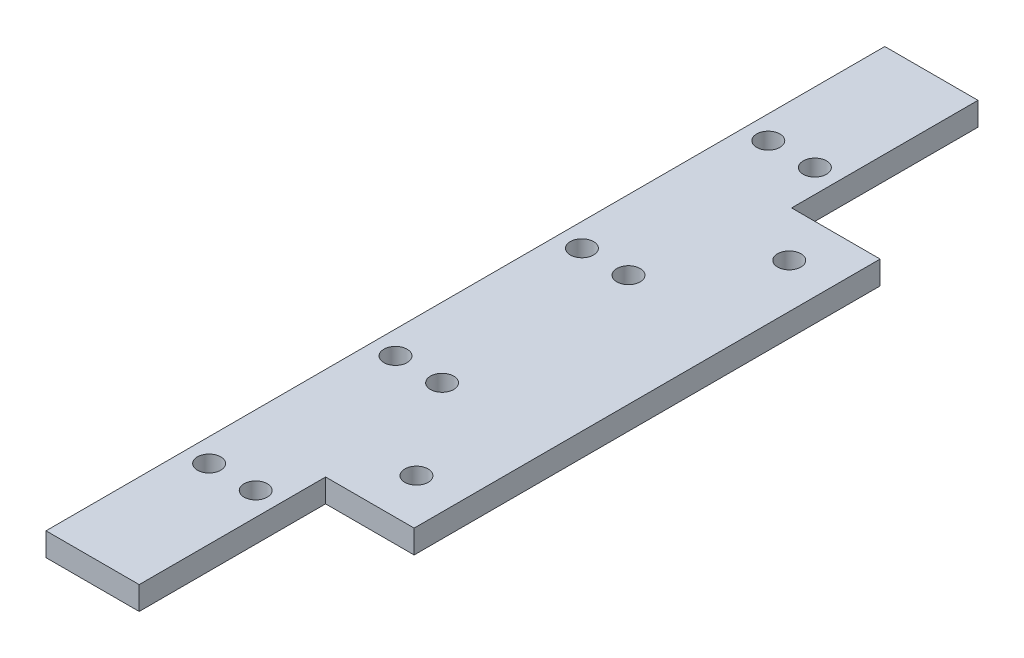
ISO-10303-21;
HEADER;
FILE_DESCRIPTION(('STEP AP214'),'2;1');
FILE_NAME('part.step','',(''),(''),'','','');
FILE_SCHEMA(('AUTOMOTIVE_DESIGN { 1 0 10303 214 1 1 1 1 }'));
ENDSEC;
DATA;
#1=APPLICATION_CONTEXT('core data for automotive mechanical design processes');
#2=APPLICATION_PROTOCOL_DEFINITION('international standard','automotive_design',2000,#1);
#3=PRODUCT_CONTEXT('',#1,'mechanical');
#4=PRODUCT('Part','Part','',(#3));
#5=PRODUCT_RELATED_PRODUCT_CATEGORY('part','',(#4));
#6=PRODUCT_DEFINITION_FORMATION('','',#4);
#7=PRODUCT_DEFINITION_CONTEXT('part definition',#1,'design');
#8=PRODUCT_DEFINITION('design','',#6,#7);
#9=PRODUCT_DEFINITION_SHAPE('','',#8);
#10=(LENGTH_UNIT() NAMED_UNIT(*) SI_UNIT(.MILLI.,.METRE.));
#11=(NAMED_UNIT(*) PLANE_ANGLE_UNIT() SI_UNIT($,.RADIAN.));
#12=(NAMED_UNIT(*) SI_UNIT($,.STERADIAN.) SOLID_ANGLE_UNIT());
#13=UNCERTAINTY_MEASURE_WITH_UNIT(LENGTH_MEASURE(1.E-05),#10,'distance_accuracy_value','');
#14=(GEOMETRIC_REPRESENTATION_CONTEXT(3) GLOBAL_UNCERTAINTY_ASSIGNED_CONTEXT((#13)) GLOBAL_UNIT_ASSIGNED_CONTEXT((#10,
#11,#12)) REPRESENTATION_CONTEXT('',''));
#15=CARTESIAN_POINT('',(0.,0.,0.));
#16=DIRECTION('',(0.,0.,1.));
#17=DIRECTION('',(1.,0.,0.));
#18=AXIS2_PLACEMENT_3D('',#15,#16,#17);
#19=CARTESIAN_POINT('',(0.,6.35,-127.));
#20=DIRECTION('',(0.,0.,1.));
#21=DIRECTION('',(1.,0.,0.));
#22=AXIS2_PLACEMENT_3D('',#19,#20,#21);
#23=PLANE('',#22);
#24=DIRECTION('',(0.,-1.,0.));
#25=VECTOR('',#24,1.);
#26=CARTESIAN_POINT('',(0.,6.35,-127.));
#27=LINE('',#26,#25);
#28=CARTESIAN_POINT('',(0.,6.35,-127.));
#29=VERTEX_POINT('',#28);
#30=CARTESIAN_POINT('',(0.,0.,-127.));
#31=VERTEX_POINT('',#30);
#32=EDGE_CURVE('E48',#29,#31,#27,.T.);
#33=ORIENTED_EDGE('',*,*,#32,.F.);
#34=DIRECTION('',(-1.,0.,0.));
#35=VECTOR('',#34,1.);
#36=CARTESIAN_POINT('',(0.,6.35,-127.));
#37=LINE('',#36,#35);
#38=CARTESIAN_POINT('',(24.13,6.35,-127.));
#39=VERTEX_POINT('',#38);
#40=EDGE_CURVE('E170',#39,#29,#37,.T.);
#41=ORIENTED_EDGE('',*,*,#40,.F.);
#42=DIRECTION('',(0.,-1.,0.));
#43=VECTOR('',#42,1.);
#44=CARTESIAN_POINT('',(24.13,6.35,-127.));
#45=LINE('',#44,#43);
#46=CARTESIAN_POINT('',(24.13,0.,-127.));
#47=VERTEX_POINT('',#46);
#48=EDGE_CURVE('E41',#39,#47,#45,.T.);
#49=ORIENTED_EDGE('',*,*,#48,.T.);
#50=DIRECTION('',(-1.,0.,0.));
#51=VECTOR('',#50,1.);
#52=CARTESIAN_POINT('',(0.,0.,-127.));
#53=LINE('',#52,#51);
#54=EDGE_CURVE('E168',#47,#31,#53,.T.);
#55=ORIENTED_EDGE('',*,*,#54,.T.);
#56=EDGE_LOOP('',(#33,#41,#49,#55));
#57=FACE_BOUND('',#56,.T.);
#58=ADVANCED_FACE('F33',(#57),#23,.F.);
#59=CARTESIAN_POINT('',(0.,6.35,0.));
#60=DIRECTION('',(0.,0.,-1.));
#61=DIRECTION('',(-1.,0.,0.));
#62=AXIS2_PLACEMENT_3D('',#59,#60,#61);
#63=PLANE('',#62);
#64=DIRECTION('',(0.,1.,0.));
#65=VECTOR('',#64,1.);
#66=CARTESIAN_POINT('',(0.,6.35,0.));
#67=LINE('',#66,#65);
#68=CARTESIAN_POINT('',(0.,0.,0.));
#69=VERTEX_POINT('',#68);
#70=CARTESIAN_POINT('',(0.,6.35,0.));
#71=VERTEX_POINT('',#70);
#72=EDGE_CURVE('E56',#69,#71,#67,.T.);
#73=ORIENTED_EDGE('',*,*,#72,.F.);
#74=DIRECTION('',(1.,0.,0.));
#75=VECTOR('',#74,1.);
#76=CARTESIAN_POINT('',(0.,0.,0.));
#77=LINE('',#76,#75);
#78=CARTESIAN_POINT('',(24.13,0.,0.));
#79=VERTEX_POINT('',#78);
#80=EDGE_CURVE('E156',#69,#79,#77,.T.);
#81=ORIENTED_EDGE('',*,*,#80,.T.);
#82=DIRECTION('',(0.,-1.,0.));
#83=VECTOR('',#82,1.);
#84=CARTESIAN_POINT('',(24.13,6.35,0.));
#85=LINE('',#84,#83);
#86=CARTESIAN_POINT('',(24.13,6.35,0.));
#87=VERTEX_POINT('',#86);
#88=EDGE_CURVE('E11',#87,#79,#85,.T.);
#89=ORIENTED_EDGE('',*,*,#88,.F.);
#90=DIRECTION('',(1.,0.,0.));
#91=VECTOR('',#90,1.);
#92=CARTESIAN_POINT('',(0.,6.35,0.));
#93=LINE('',#92,#91);
#94=EDGE_CURVE('E165',#71,#87,#93,.T.);
#95=ORIENTED_EDGE('',*,*,#94,.F.);
#96=EDGE_LOOP('',(#73,#81,#89,#95));
#97=FACE_BOUND('',#96,.T.);
#98=ADVANCED_FACE('F35',(#97),#63,.F.);
#99=CARTESIAN_POINT('',(24.13,6.35,0.));
#100=DIRECTION('',(-1.,0.,0.));
#101=DIRECTION('',(0.,0.,1.));
#102=AXIS2_PLACEMENT_3D('',#99,#100,#101);
#103=PLANE('',#102);
#104=DIRECTION('',(0.,0.,-1.));
#105=VECTOR('',#104,1.);
#106=CARTESIAN_POINT('',(24.13,0.,0.));
#107=LINE('',#106,#105);
#108=EDGE_CURVE('E173',#79,#47,#107,.T.);
#109=ORIENTED_EDGE('',*,*,#108,.T.);
#110=ORIENTED_EDGE('',*,*,#48,.F.);
#111=DIRECTION('',(0.,0.,-1.));
#112=VECTOR('',#111,1.);
#113=CARTESIAN_POINT('',(24.13,6.35,0.));
#114=LINE('',#113,#112);
#115=EDGE_CURVE('E167',#87,#39,#114,.T.);
#116=ORIENTED_EDGE('',*,*,#115,.F.);
#117=ORIENTED_EDGE('',*,*,#88,.T.);
#118=EDGE_LOOP('',(#109,#110,#116,#117));
#119=FACE_BOUND('',#118,.T.);
#120=ADVANCED_FACE('F203',(#119),#103,.F.);
#121=CARTESIAN_POINT('',(0.,6.35,0.));
#122=DIRECTION('',(0.,-1.,0.));
#123=DIRECTION('',(0.,0.,-1.));
#124=AXIS2_PLACEMENT_3D('',#121,#122,#123);
#125=PLANE('',#124);
#126=CARTESIAN_POINT('',(-19.0499999999989,6.35,-38.0999999999999));
#127=DIRECTION('',(0.,1.,0.));
#128=DIRECTION('',(0.,0.,1.));
#129=AXIS2_PLACEMENT_3D('',#126,#127,#128);
#130=CIRCLE('',#129,3.175);
#131=CARTESIAN_POINT('',(-19.0499999999989,6.35,-34.9249999999999));
#132=VERTEX_POINT('',#131);
#133=EDGE_CURVE('E288',#132,#132,#130,.T.);
#134=ORIENTED_EDGE('',*,*,#133,.F.);
#135=EDGE_LOOP('',(#134));
#136=FACE_BOUND('',#135,.T.);
#137=CARTESIAN_POINT('',(-6.34999999999948,6.35,-88.9));
#138=DIRECTION('',(0.,1.,0.));
#139=DIRECTION('',(0.,0.,1.));
#140=AXIS2_PLACEMENT_3D('',#137,#138,#139);
#141=CIRCLE('',#140,3.175);
#142=CARTESIAN_POINT('',(-6.34999999999948,6.35,-85.725));
#143=VERTEX_POINT('',#142);
#144=EDGE_CURVE('E292',#143,#143,#141,.T.);
#145=ORIENTED_EDGE('',*,*,#144,.F.);
#146=EDGE_LOOP('',(#145));
#147=FACE_BOUND('',#146,.T.);
#148=CARTESIAN_POINT('',(-19.0499999999995,6.35,-88.8999999999999));
#149=DIRECTION('',(0.,1.,0.));
#150=DIRECTION('',(0.,0.,1.));
#151=AXIS2_PLACEMENT_3D('',#148,#149,#150);
#152=CIRCLE('',#151,3.175);
#153=CARTESIAN_POINT('',(-19.0499999999995,6.35,-85.7249999999999));
#154=VERTEX_POINT('',#153);
#155=EDGE_CURVE('E280',#154,#154,#152,.T.);
#156=ORIENTED_EDGE('',*,*,#155,.F.);
#157=EDGE_LOOP('',(#156));
#158=FACE_BOUND('',#157,.T.);
#159=CARTESIAN_POINT('',(-19.05,6.35,-139.7));
#160=DIRECTION('',(0.,1.,0.));
#161=DIRECTION('',(0.,0.,1.));
#162=AXIS2_PLACEMENT_3D('',#159,#160,#161);
#163=CIRCLE('',#162,3.175);
#164=CARTESIAN_POINT('',(-19.05,6.35,-136.525));
#165=VERTEX_POINT('',#164);
#166=EDGE_CURVE('E284',#165,#165,#163,.T.);
#167=ORIENTED_EDGE('',*,*,#166,.F.);
#168=EDGE_LOOP('',(#167));
#169=FACE_BOUND('',#168,.T.);
#170=CARTESIAN_POINT('',(-6.34999999999895,6.35,-38.1));
#171=DIRECTION('',(0.,1.,0.));
#172=DIRECTION('',(0.,0.,1.));
#173=AXIS2_PLACEMENT_3D('',#170,#171,#172);
#174=CIRCLE('',#173,3.175);
#175=CARTESIAN_POINT('',(-6.34999999999895,6.35,-34.925));
#176=VERTEX_POINT('',#175);
#177=EDGE_CURVE('E304',#176,#176,#174,.T.);
#178=ORIENTED_EDGE('',*,*,#177,.F.);
#179=EDGE_LOOP('',(#178));
#180=FACE_BOUND('',#179,.T.);
#181=CARTESIAN_POINT('',(-6.34999999999842,6.35,12.7));
#182=DIRECTION('',(0.,1.,0.));
#183=DIRECTION('',(0.,0.,1.));
#184=AXIS2_PLACEMENT_3D('',#181,#182,#183);
#185=CIRCLE('',#184,3.175);
#186=CARTESIAN_POINT('',(-6.34999999999842,6.35,15.875));
#187=VERTEX_POINT('',#186);
#188=EDGE_CURVE('E300',#187,#187,#185,.T.);
#189=ORIENTED_EDGE('',*,*,#188,.F.);
#190=EDGE_LOOP('',(#189));
#191=FACE_BOUND('',#190,.T.);
#192=CARTESIAN_POINT('',(-19.0499999999984,6.35,12.7));
#193=DIRECTION('',(0.,1.,0.));
#194=DIRECTION('',(0.,0.,1.));
#195=AXIS2_PLACEMENT_3D('',#192,#193,#194);
#196=CIRCLE('',#195,3.175);
#197=CARTESIAN_POINT('',(-19.0499999999984,6.35,15.875));
#198=VERTEX_POINT('',#197);
#199=EDGE_CURVE('E296',#198,#198,#196,.T.);
#200=ORIENTED_EDGE('',*,*,#199,.F.);
#201=EDGE_LOOP('',(#200));
#202=FACE_BOUND('',#201,.T.);
#203=CARTESIAN_POINT('',(-6.35000000000001,6.35,-139.7));
#204=DIRECTION('',(0.,1.,0.));
#205=DIRECTION('',(0.,0.,1.));
#206=AXIS2_PLACEMENT_3D('',#203,#204,#205);
#207=CIRCLE('',#206,3.175);
#208=CARTESIAN_POINT('',(-6.35000000000001,6.35,-136.525));
#209=VERTEX_POINT('',#208);
#210=EDGE_CURVE('E129',#209,#209,#207,.T.);
#211=ORIENTED_EDGE('',*,*,#210,.F.);
#212=EDGE_LOOP('',(#211));
#213=FACE_BOUND('',#212,.T.);
#214=CARTESIAN_POINT('',(12.0650000000004,6.35,-114.3));
#215=DIRECTION('',(0.,1.,0.));
#216=DIRECTION('',(0.,0.,1.));
#217=AXIS2_PLACEMENT_3D('',#214,#215,#216);
#218=CIRCLE('',#217,3.175);
#219=CARTESIAN_POINT('',(12.0650000000004,6.35,-111.125));
#220=VERTEX_POINT('',#219);
#221=EDGE_CURVE('E157',#220,#220,#218,.T.);
#222=ORIENTED_EDGE('',*,*,#221,.F.);
#223=EDGE_LOOP('',(#222));
#224=FACE_BOUND('',#223,.T.);
#225=CARTESIAN_POINT('',(12.065,6.35,-12.7));
#226=DIRECTION('',(0.,1.,0.));
#227=DIRECTION('',(0.,0.,1.));
#228=AXIS2_PLACEMENT_3D('',#225,#226,#227);
#229=CIRCLE('',#228,3.175);
#230=CARTESIAN_POINT('',(12.065,6.35,-9.525));
#231=VERTEX_POINT('',#230);
#232=EDGE_CURVE('E109',#231,#231,#229,.T.);
#233=ORIENTED_EDGE('',*,*,#232,.F.);
#234=EDGE_LOOP('',(#233));
#235=FACE_BOUND('',#234,.T.);
#236=ORIENTED_EDGE('',*,*,#40,.T.);
#237=DIRECTION('',(0.,0.,1.));
#238=VECTOR('',#237,1.);
#239=CARTESIAN_POINT('',(0.,6.35,-177.8));
#240=LINE('',#239,#238);
#241=CARTESIAN_POINT('',(0.,6.35,-177.8));
#242=VERTEX_POINT('',#241);
#243=EDGE_CURVE('E116',#242,#29,#240,.T.);
#244=ORIENTED_EDGE('',*,*,#243,.F.);
#245=DIRECTION('',(1.,0.,0.));
#246=VECTOR('',#245,1.);
#247=CARTESIAN_POINT('',(-25.4,6.35,-177.8));
#248=LINE('',#247,#246);
#249=CARTESIAN_POINT('',(-25.4,6.35,-177.8));
#250=VERTEX_POINT('',#249);
#251=EDGE_CURVE('E113',#250,#242,#248,.T.);
#252=ORIENTED_EDGE('',*,*,#251,.F.);
#253=DIRECTION('',(0.,0.,-1.));
#254=VECTOR('',#253,1.);
#255=CARTESIAN_POINT('',(-25.4,6.35,-127.));
#256=LINE('',#255,#254);
#257=CARTESIAN_POINT('',(-25.4,6.35,50.8));
#258=VERTEX_POINT('',#257);
#259=EDGE_CURVE('E99',#258,#250,#256,.T.);
#260=ORIENTED_EDGE('',*,*,#259,.F.);
#261=DIRECTION('',(-1.,0.,0.));
#262=VECTOR('',#261,1.);
#263=CARTESIAN_POINT('',(-25.4,6.35,50.8));
#264=LINE('',#263,#262);
#265=CARTESIAN_POINT('',(0.,6.35,50.8));
#266=VERTEX_POINT('',#265);
#267=EDGE_CURVE('E143',#266,#258,#264,.T.);
#268=ORIENTED_EDGE('',*,*,#267,.F.);
#269=DIRECTION('',(0.,0.,-1.));
#270=VECTOR('',#269,1.);
#271=CARTESIAN_POINT('',(0.,6.35,50.8));
#272=LINE('',#271,#270);
#273=EDGE_CURVE('E145',#266,#71,#272,.T.);
#274=ORIENTED_EDGE('',*,*,#273,.T.);
#275=ORIENTED_EDGE('',*,*,#94,.T.);
#276=ORIENTED_EDGE('',*,*,#115,.T.);
#277=EDGE_LOOP('',(#236,#244,#252,#260,#268,#274,#275,#276));
#278=FACE_BOUND('',#277,.T.);
#279=ADVANCED_FACE('F114',(#136,#147,#158,#169,#180,#191,#202,#213,#224,#235,#278),#125,.F.);
#280=CARTESIAN_POINT('',(0.,0.,0.));
#281=DIRECTION('',(0.,-1.,0.));
#282=DIRECTION('',(0.,0.,-1.));
#283=AXIS2_PLACEMENT_3D('',#280,#281,#282);
#284=PLANE('',#283);
#285=CARTESIAN_POINT('',(-19.0499999999989,0.,-38.0999999999999));
#286=DIRECTION('',(0.,1.,0.));
#287=DIRECTION('',(0.,0.,1.));
#288=AXIS2_PLACEMENT_3D('',#285,#286,#287);
#289=CIRCLE('',#288,3.175);
#290=CARTESIAN_POINT('',(-19.0499999999989,0.,-34.9249999999999));
#291=VERTEX_POINT('',#290);
#292=EDGE_CURVE('E245',#291,#291,#289,.T.);
#293=ORIENTED_EDGE('',*,*,#292,.T.);
#294=EDGE_LOOP('',(#293));
#295=FACE_BOUND('',#294,.T.);
#296=CARTESIAN_POINT('',(-6.34999999999948,0.,-88.9));
#297=DIRECTION('',(0.,1.,0.));
#298=DIRECTION('',(0.,0.,1.));
#299=AXIS2_PLACEMENT_3D('',#296,#297,#298);
#300=CIRCLE('',#299,3.175);
#301=CARTESIAN_POINT('',(-6.34999999999948,0.,-85.725));
#302=VERTEX_POINT('',#301);
#303=EDGE_CURVE('E249',#302,#302,#300,.T.);
#304=ORIENTED_EDGE('',*,*,#303,.T.);
#305=EDGE_LOOP('',(#304));
#306=FACE_BOUND('',#305,.T.);
#307=CARTESIAN_POINT('',(-19.0499999999995,0.,-88.8999999999999));
#308=DIRECTION('',(0.,1.,0.));
#309=DIRECTION('',(0.,0.,1.));
#310=AXIS2_PLACEMENT_3D('',#307,#308,#309);
#311=CIRCLE('',#310,3.175);
#312=CARTESIAN_POINT('',(-19.0499999999995,0.,-85.7249999999999));
#313=VERTEX_POINT('',#312);
#314=EDGE_CURVE('E253',#313,#313,#311,.T.);
#315=ORIENTED_EDGE('',*,*,#314,.T.);
#316=EDGE_LOOP('',(#315));
#317=FACE_BOUND('',#316,.T.);
#318=CARTESIAN_POINT('',(-19.05,0.,-139.7));
#319=DIRECTION('',(0.,1.,0.));
#320=DIRECTION('',(0.,0.,1.));
#321=AXIS2_PLACEMENT_3D('',#318,#319,#320);
#322=CIRCLE('',#321,3.175);
#323=CARTESIAN_POINT('',(-19.05,0.,-136.525));
#324=VERTEX_POINT('',#323);
#325=EDGE_CURVE('E257',#324,#324,#322,.T.);
#326=ORIENTED_EDGE('',*,*,#325,.T.);
#327=EDGE_LOOP('',(#326));
#328=FACE_BOUND('',#327,.T.);
#329=CARTESIAN_POINT('',(-6.34999999999895,0.,-38.1));
#330=DIRECTION('',(0.,1.,0.));
#331=DIRECTION('',(0.,0.,1.));
#332=AXIS2_PLACEMENT_3D('',#329,#330,#331);
#333=CIRCLE('',#332,3.175);
#334=CARTESIAN_POINT('',(-6.34999999999895,0.,-34.925));
#335=VERTEX_POINT('',#334);
#336=EDGE_CURVE('E261',#335,#335,#333,.T.);
#337=ORIENTED_EDGE('',*,*,#336,.T.);
#338=EDGE_LOOP('',(#337));
#339=FACE_BOUND('',#338,.T.);
#340=CARTESIAN_POINT('',(-6.34999999999842,0.,12.7));
#341=DIRECTION('',(0.,1.,0.));
#342=DIRECTION('',(0.,0.,1.));
#343=AXIS2_PLACEMENT_3D('',#340,#341,#342);
#344=CIRCLE('',#343,3.175);
#345=CARTESIAN_POINT('',(-6.34999999999842,0.,15.875));
#346=VERTEX_POINT('',#345);
#347=EDGE_CURVE('E265',#346,#346,#344,.T.);
#348=ORIENTED_EDGE('',*,*,#347,.T.);
#349=EDGE_LOOP('',(#348));
#350=FACE_BOUND('',#349,.T.);
#351=CARTESIAN_POINT('',(-19.0499999999984,0.,12.7));
#352=DIRECTION('',(0.,1.,0.));
#353=DIRECTION('',(0.,0.,1.));
#354=AXIS2_PLACEMENT_3D('',#351,#352,#353);
#355=CIRCLE('',#354,3.175);
#356=CARTESIAN_POINT('',(-19.0499999999984,0.,15.875));
#357=VERTEX_POINT('',#356);
#358=EDGE_CURVE('E269',#357,#357,#355,.T.);
#359=ORIENTED_EDGE('',*,*,#358,.T.);
#360=EDGE_LOOP('',(#359));
#361=FACE_BOUND('',#360,.T.);
#362=CARTESIAN_POINT('',(-6.35000000000001,0.,-139.7));
#363=DIRECTION('',(0.,1.,0.));
#364=DIRECTION('',(0.,0.,1.));
#365=AXIS2_PLACEMENT_3D('',#362,#363,#364);
#366=CIRCLE('',#365,3.175);
#367=CARTESIAN_POINT('',(-6.35000000000001,0.,-136.525));
#368=VERTEX_POINT('',#367);
#369=EDGE_CURVE('E126',#368,#368,#366,.T.);
#370=ORIENTED_EDGE('',*,*,#369,.T.);
#371=EDGE_LOOP('',(#370));
#372=FACE_BOUND('',#371,.T.);
#373=CARTESIAN_POINT('',(12.0650000000004,0.,-114.3));
#374=DIRECTION('',(0.,1.,0.));
#375=DIRECTION('',(0.,0.,1.));
#376=AXIS2_PLACEMENT_3D('',#373,#374,#375);
#377=CIRCLE('',#376,3.175);
#378=CARTESIAN_POINT('',(12.0650000000004,0.,-111.125));
#379=VERTEX_POINT('',#378);
#380=EDGE_CURVE('E153',#379,#379,#377,.T.);
#381=ORIENTED_EDGE('',*,*,#380,.T.);
#382=EDGE_LOOP('',(#381));
#383=FACE_BOUND('',#382,.T.);
#384=CARTESIAN_POINT('',(12.065,0.,-12.7));
#385=DIRECTION('',(0.,1.,0.));
#386=DIRECTION('',(0.,0.,1.));
#387=AXIS2_PLACEMENT_3D('',#384,#385,#386);
#388=CIRCLE('',#387,3.175);
#389=CARTESIAN_POINT('',(12.065,0.,-9.525));
#390=VERTEX_POINT('',#389);
#391=EDGE_CURVE('E160',#390,#390,#388,.T.);
#392=ORIENTED_EDGE('',*,*,#391,.T.);
#393=EDGE_LOOP('',(#392));
#394=FACE_BOUND('',#393,.T.);
#395=ORIENTED_EDGE('',*,*,#80,.F.);
#396=DIRECTION('',(0.,0.,-1.));
#397=VECTOR('',#396,1.);
#398=CARTESIAN_POINT('',(0.,0.,50.8));
#399=LINE('',#398,#397);
#400=CARTESIAN_POINT('',(0.,0.,50.8));
#401=VERTEX_POINT('',#400);
#402=EDGE_CURVE('E149',#401,#69,#399,.T.);
#403=ORIENTED_EDGE('',*,*,#402,.F.);
#404=DIRECTION('',(1.,0.,0.));
#405=VECTOR('',#404,1.);
#406=CARTESIAN_POINT('',(-25.4,0.,50.8));
#407=LINE('',#406,#405);
#408=CARTESIAN_POINT('',(-25.4,0.,50.8));
#409=VERTEX_POINT('',#408);
#410=EDGE_CURVE('E139',#409,#401,#407,.T.);
#411=ORIENTED_EDGE('',*,*,#410,.F.);
#412=DIRECTION('',(0.,0.,1.));
#413=VECTOR('',#412,1.);
#414=CARTESIAN_POINT('',(-25.4,0.,-127.));
#415=LINE('',#414,#413);
#416=CARTESIAN_POINT('',(-25.4,0.,-177.8));
#417=VERTEX_POINT('',#416);
#418=EDGE_CURVE('E110',#417,#409,#415,.T.);
#419=ORIENTED_EDGE('',*,*,#418,.F.);
#420=DIRECTION('',(-1.,0.,0.));
#421=VECTOR('',#420,1.);
#422=CARTESIAN_POINT('',(-25.4,0.,-177.8));
#423=LINE('',#422,#421);
#424=CARTESIAN_POINT('',(0.,0.,-177.8));
#425=VERTEX_POINT('',#424);
#426=EDGE_CURVE('E124',#425,#417,#423,.T.);
#427=ORIENTED_EDGE('',*,*,#426,.F.);
#428=DIRECTION('',(0.,0.,1.));
#429=VECTOR('',#428,1.);
#430=CARTESIAN_POINT('',(0.,0.,-177.8));
#431=LINE('',#430,#429);
#432=EDGE_CURVE('E133',#425,#31,#431,.T.);
#433=ORIENTED_EDGE('',*,*,#432,.T.);
#434=ORIENTED_EDGE('',*,*,#54,.F.);
#435=ORIENTED_EDGE('',*,*,#108,.F.);
#436=EDGE_LOOP('',(#395,#403,#411,#419,#427,#433,#434,#435));
#437=FACE_BOUND('',#436,.T.);
#438=ADVANCED_FACE('F182',(#295,#306,#317,#328,#339,#350,#361,#372,#383,#394,#437),#284,.T.);
#439=CARTESIAN_POINT('',(12.065,0.,-12.7));
#440=DIRECTION('',(0.,1.,0.));
#441=DIRECTION('',(0.,0.,1.));
#442=AXIS2_PLACEMENT_3D('',#439,#440,#441);
#443=CYLINDRICAL_SURFACE('',#442,3.175);
#444=ORIENTED_EDGE('',*,*,#391,.F.);
#445=EDGE_LOOP('',(#444));
#446=FACE_BOUND('',#445,.T.);
#447=ORIENTED_EDGE('',*,*,#232,.T.);
#448=EDGE_LOOP('',(#447));
#449=FACE_BOUND('',#448,.T.);
#450=ADVANCED_FACE('F227',(#446,#449),#443,.F.);
#451=CARTESIAN_POINT('',(12.0650000000004,0.,-114.3));
#452=DIRECTION('',(0.,1.,0.));
#453=DIRECTION('',(0.,0.,1.));
#454=AXIS2_PLACEMENT_3D('',#451,#452,#453);
#455=CYLINDRICAL_SURFACE('',#454,3.175);
#456=ORIENTED_EDGE('',*,*,#380,.F.);
#457=EDGE_LOOP('',(#456));
#458=FACE_BOUND('',#457,.T.);
#459=ORIENTED_EDGE('',*,*,#221,.T.);
#460=EDGE_LOOP('',(#459));
#461=FACE_BOUND('',#460,.T.);
#462=ADVANCED_FACE('F222',(#458,#461),#455,.F.);
#463=CARTESIAN_POINT('',(-25.4,0.,0.));
#464=DIRECTION('',(1.,0.,0.));
#465=DIRECTION('',(0.,0.,-1.));
#466=AXIS2_PLACEMENT_3D('',#463,#464,#465);
#467=PLANE('',#466);
#468=ORIENTED_EDGE('',*,*,#259,.T.);
#469=DIRECTION('',(0.,1.,0.));
#470=VECTOR('',#469,1.);
#471=CARTESIAN_POINT('',(-25.4,6.35,-177.8));
#472=LINE('',#471,#470);
#473=EDGE_CURVE('E103',#417,#250,#472,.T.);
#474=ORIENTED_EDGE('',*,*,#473,.F.);
#475=ORIENTED_EDGE('',*,*,#418,.T.);
#476=DIRECTION('',(0.,-1.,0.));
#477=VECTOR('',#476,1.);
#478=CARTESIAN_POINT('',(-25.4,6.35,50.8));
#479=LINE('',#478,#477);
#480=EDGE_CURVE('E105',#258,#409,#479,.T.);
#481=ORIENTED_EDGE('',*,*,#480,.F.);
#482=EDGE_LOOP('',(#468,#474,#475,#481));
#483=FACE_BOUND('',#482,.T.);
#484=ADVANCED_FACE('F101',(#483),#467,.F.);
#485=CARTESIAN_POINT('',(0.,6.35,50.8));
#486=DIRECTION('',(-1.,0.,0.));
#487=DIRECTION('',(0.,0.,1.));
#488=AXIS2_PLACEMENT_3D('',#485,#486,#487);
#489=PLANE('',#488);
#490=ORIENTED_EDGE('',*,*,#72,.T.);
#491=ORIENTED_EDGE('',*,*,#273,.F.);
#492=DIRECTION('',(0.,1.,0.));
#493=VECTOR('',#492,1.);
#494=CARTESIAN_POINT('',(0.,6.35,50.8));
#495=LINE('',#494,#493);
#496=EDGE_CURVE('E141',#401,#266,#495,.T.);
#497=ORIENTED_EDGE('',*,*,#496,.F.);
#498=ORIENTED_EDGE('',*,*,#402,.T.);
#499=EDGE_LOOP('',(#490,#491,#497,#498));
#500=FACE_BOUND('',#499,.T.);
#501=ADVANCED_FACE('F195',(#500),#489,.F.);
#502=CARTESIAN_POINT('',(0.,0.,50.8));
#503=DIRECTION('',(0.,0.,1.));
#504=DIRECTION('',(1.,0.,0.));
#505=AXIS2_PLACEMENT_3D('',#502,#503,#504);
#506=PLANE('',#505);
#507=ORIENTED_EDGE('',*,*,#480,.T.);
#508=ORIENTED_EDGE('',*,*,#410,.T.);
#509=ORIENTED_EDGE('',*,*,#496,.T.);
#510=ORIENTED_EDGE('',*,*,#267,.T.);
#511=EDGE_LOOP('',(#507,#508,#509,#510));
#512=FACE_BOUND('',#511,.T.);
#513=ADVANCED_FACE('F187',(#512),#506,.T.);
#514=CARTESIAN_POINT('',(0.,6.35,-177.8));
#515=DIRECTION('',(-1.,0.,0.));
#516=DIRECTION('',(0.,0.,1.));
#517=AXIS2_PLACEMENT_3D('',#514,#515,#516);
#518=PLANE('',#517);
#519=ORIENTED_EDGE('',*,*,#32,.T.);
#520=ORIENTED_EDGE('',*,*,#432,.F.);
#521=DIRECTION('',(0.,-1.,0.));
#522=VECTOR('',#521,1.);
#523=CARTESIAN_POINT('',(0.,6.35,-177.8));
#524=LINE('',#523,#522);
#525=EDGE_CURVE('E119',#242,#425,#524,.T.);
#526=ORIENTED_EDGE('',*,*,#525,.F.);
#527=ORIENTED_EDGE('',*,*,#243,.T.);
#528=EDGE_LOOP('',(#519,#520,#526,#527));
#529=FACE_BOUND('',#528,.T.);
#530=ADVANCED_FACE('F185',(#529),#518,.F.);
#531=CARTESIAN_POINT('',(0.,0.,-177.8));
#532=DIRECTION('',(0.,0.,1.));
#533=DIRECTION('',(1.,0.,0.));
#534=AXIS2_PLACEMENT_3D('',#531,#532,#533);
#535=PLANE('',#534);
#536=ORIENTED_EDGE('',*,*,#473,.T.);
#537=ORIENTED_EDGE('',*,*,#251,.T.);
#538=ORIENTED_EDGE('',*,*,#525,.T.);
#539=ORIENTED_EDGE('',*,*,#426,.T.);
#540=EDGE_LOOP('',(#536,#537,#538,#539));
#541=FACE_BOUND('',#540,.T.);
#542=ADVANCED_FACE('F122',(#541),#535,.F.);
#543=CARTESIAN_POINT('',(-6.35000000000001,0.,-139.7));
#544=DIRECTION('',(0.,1.,0.));
#545=DIRECTION('',(0.,0.,1.));
#546=AXIS2_PLACEMENT_3D('',#543,#544,#545);
#547=CYLINDRICAL_SURFACE('',#546,3.175);
#548=ORIENTED_EDGE('',*,*,#369,.F.);
#549=EDGE_LOOP('',(#548));
#550=FACE_BOUND('',#549,.T.);
#551=ORIENTED_EDGE('',*,*,#210,.T.);
#552=EDGE_LOOP('',(#551));
#553=FACE_BOUND('',#552,.T.);
#554=ADVANCED_FACE('F193',(#550,#553),#547,.F.);
#555=CARTESIAN_POINT('',(-19.0499999999984,0.,12.7));
#556=DIRECTION('',(0.,1.,0.));
#557=DIRECTION('',(0.,0.,1.));
#558=AXIS2_PLACEMENT_3D('',#555,#556,#557);
#559=CYLINDRICAL_SURFACE('',#558,3.175);
#560=ORIENTED_EDGE('',*,*,#358,.F.);
#561=EDGE_LOOP('',(#560));
#562=FACE_BOUND('',#561,.T.);
#563=ORIENTED_EDGE('',*,*,#199,.T.);
#564=EDGE_LOOP('',(#563));
#565=FACE_BOUND('',#564,.T.);
#566=ADVANCED_FACE('F319',(#562,#565),#559,.F.);
#567=CARTESIAN_POINT('',(-6.34999999999842,0.,12.7));
#568=DIRECTION('',(0.,1.,0.));
#569=DIRECTION('',(0.,0.,1.));
#570=AXIS2_PLACEMENT_3D('',#567,#568,#569);
#571=CYLINDRICAL_SURFACE('',#570,3.175);
#572=ORIENTED_EDGE('',*,*,#347,.F.);
#573=EDGE_LOOP('',(#572));
#574=FACE_BOUND('',#573,.T.);
#575=ORIENTED_EDGE('',*,*,#188,.T.);
#576=EDGE_LOOP('',(#575));
#577=FACE_BOUND('',#576,.T.);
#578=ADVANCED_FACE('F324',(#574,#577),#571,.F.);
#579=CARTESIAN_POINT('',(-6.34999999999895,0.,-38.1));
#580=DIRECTION('',(0.,1.,0.));
#581=DIRECTION('',(0.,0.,1.));
#582=AXIS2_PLACEMENT_3D('',#579,#580,#581);
#583=CYLINDRICAL_SURFACE('',#582,3.175);
#584=ORIENTED_EDGE('',*,*,#336,.F.);
#585=EDGE_LOOP('',(#584));
#586=FACE_BOUND('',#585,.T.);
#587=ORIENTED_EDGE('',*,*,#177,.T.);
#588=EDGE_LOOP('',(#587));
#589=FACE_BOUND('',#588,.T.);
#590=ADVANCED_FACE('F309',(#586,#589),#583,.F.);
#591=CARTESIAN_POINT('',(-19.05,0.,-139.7));
#592=DIRECTION('',(0.,1.,0.));
#593=DIRECTION('',(0.,0.,1.));
#594=AXIS2_PLACEMENT_3D('',#591,#592,#593);
#595=CYLINDRICAL_SURFACE('',#594,3.175);
#596=ORIENTED_EDGE('',*,*,#325,.F.);
#597=EDGE_LOOP('',(#596));
#598=FACE_BOUND('',#597,.T.);
#599=ORIENTED_EDGE('',*,*,#166,.T.);
#600=EDGE_LOOP('',(#599));
#601=FACE_BOUND('',#600,.T.);
#602=ADVANCED_FACE('F332',(#598,#601),#595,.F.);
#603=CARTESIAN_POINT('',(-19.0499999999995,0.,-88.8999999999999));
#604=DIRECTION('',(0.,1.,0.));
#605=DIRECTION('',(0.,0.,1.));
#606=AXIS2_PLACEMENT_3D('',#603,#604,#605);
#607=CYLINDRICAL_SURFACE('',#606,3.175);
#608=ORIENTED_EDGE('',*,*,#314,.F.);
#609=EDGE_LOOP('',(#608));
#610=FACE_BOUND('',#609,.T.);
#611=ORIENTED_EDGE('',*,*,#155,.T.);
#612=EDGE_LOOP('',(#611));
#613=FACE_BOUND('',#612,.T.);
#614=ADVANCED_FACE('F328',(#610,#613),#607,.F.);
#615=CARTESIAN_POINT('',(-6.34999999999948,0.,-88.9));
#616=DIRECTION('',(0.,1.,0.));
#617=DIRECTION('',(0.,0.,1.));
#618=AXIS2_PLACEMENT_3D('',#615,#616,#617);
#619=CYLINDRICAL_SURFACE('',#618,3.175);
#620=ORIENTED_EDGE('',*,*,#303,.F.);
#621=EDGE_LOOP('',(#620));
#622=FACE_BOUND('',#621,.T.);
#623=ORIENTED_EDGE('',*,*,#144,.T.);
#624=EDGE_LOOP('',(#623));
#625=FACE_BOUND('',#624,.T.);
#626=ADVANCED_FACE('F331',(#622,#625),#619,.F.);
#627=CARTESIAN_POINT('',(-19.0499999999989,0.,-38.0999999999999));
#628=DIRECTION('',(0.,1.,0.));
#629=DIRECTION('',(0.,0.,1.));
#630=AXIS2_PLACEMENT_3D('',#627,#628,#629);
#631=CYLINDRICAL_SURFACE('',#630,3.175);
#632=ORIENTED_EDGE('',*,*,#292,.F.);
#633=EDGE_LOOP('',(#632));
#634=FACE_BOUND('',#633,.T.);
#635=ORIENTED_EDGE('',*,*,#133,.T.);
#636=EDGE_LOOP('',(#635));
#637=FACE_BOUND('',#636,.T.);
#638=ADVANCED_FACE('F337',(#634,#637),#631,.F.);
#639=CLOSED_SHELL('',(#58,#98,#120,#279,#438,#450,#462,#484,#501,#513,#530,#542,#554,#566,#578,
#590,#602,#614,#626,#638));
#640=MANIFOLD_SOLID_BREP('B2',#639);
#641=ADVANCED_BREP_SHAPE_REPRESENTATION('',(#18,#640),#14);
#642=SHAPE_DEFINITION_REPRESENTATION(#9,#641);
ENDSEC;
END-ISO-10303-21;
